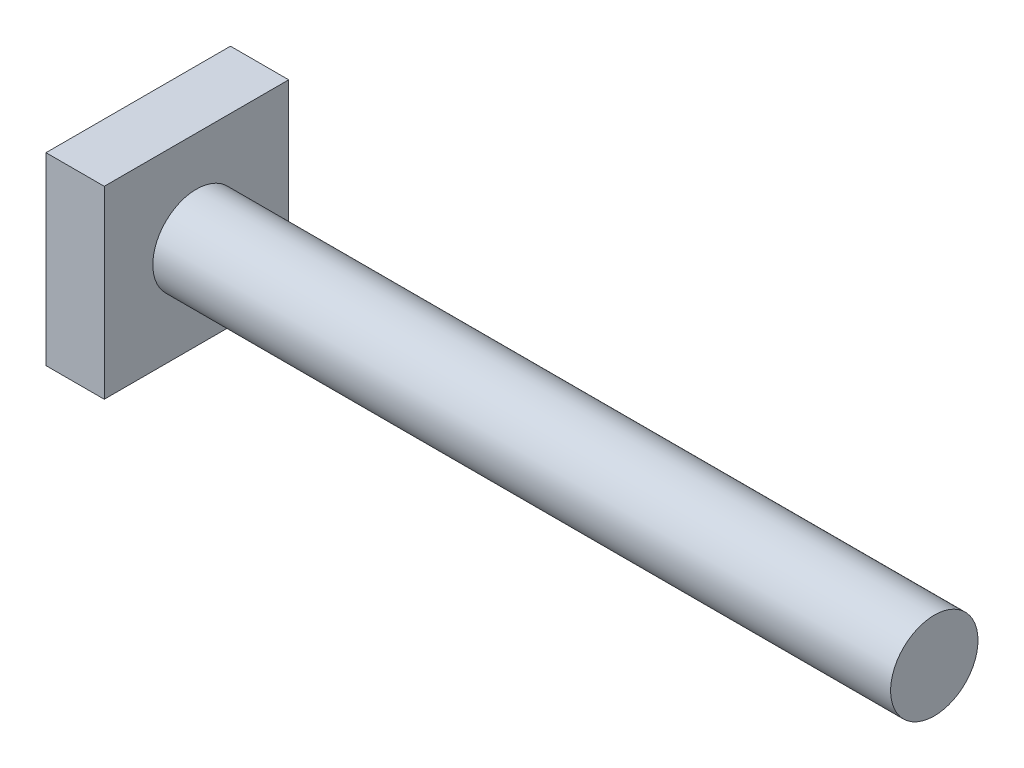
ISO-10303-21;
HEADER;
FILE_DESCRIPTION(('STEP AP214'),'2;1');
FILE_NAME('part.step','',(''),(''),'','','');
FILE_SCHEMA(('AUTOMOTIVE_DESIGN { 1 0 10303 214 1 1 1 1 }'));
ENDSEC;
DATA;
#1=APPLICATION_CONTEXT('core data for automotive mechanical design processes');
#2=APPLICATION_PROTOCOL_DEFINITION('international standard','automotive_design',2000,#1);
#3=PRODUCT_CONTEXT('',#1,'mechanical');
#4=PRODUCT('Part','Part','',(#3));
#5=PRODUCT_RELATED_PRODUCT_CATEGORY('part','',(#4));
#6=PRODUCT_DEFINITION_FORMATION('','',#4);
#7=PRODUCT_DEFINITION_CONTEXT('part definition',#1,'design');
#8=PRODUCT_DEFINITION('design','',#6,#7);
#9=PRODUCT_DEFINITION_SHAPE('','',#8);
#10=(LENGTH_UNIT() NAMED_UNIT(*) SI_UNIT(.MILLI.,.METRE.));
#11=(NAMED_UNIT(*) PLANE_ANGLE_UNIT() SI_UNIT($,.RADIAN.));
#12=(NAMED_UNIT(*) SI_UNIT($,.STERADIAN.) SOLID_ANGLE_UNIT());
#13=UNCERTAINTY_MEASURE_WITH_UNIT(LENGTH_MEASURE(1.E-05),#10,'distance_accuracy_value','');
#14=(GEOMETRIC_REPRESENTATION_CONTEXT(3) GLOBAL_UNCERTAINTY_ASSIGNED_CONTEXT((#13)) GLOBAL_UNIT_ASSIGNED_CONTEXT((#10,
#11,#12)) REPRESENTATION_CONTEXT('',''));
#15=CARTESIAN_POINT('',(0.,0.,0.));
#16=DIRECTION('',(0.,0.,1.));
#17=DIRECTION('',(1.,0.,0.));
#18=AXIS2_PLACEMENT_3D('',#15,#16,#17);
#19=CARTESIAN_POINT('',(1930.4,0.,0.));
#20=DIRECTION('',(-1.,0.,0.));
#21=DIRECTION('',(0.,0.,1.));
#22=AXIS2_PLACEMENT_3D('',#19,#20,#21);
#23=CYLINDRICAL_SURFACE('',#22,114.3);
#24=CARTESIAN_POINT('',(1930.4,0.,0.));
#25=DIRECTION('',(1.,0.,0.));
#26=DIRECTION('',(0.,0.,-1.));
#27=AXIS2_PLACEMENT_3D('',#24,#25,#26);
#28=CIRCLE('',#27,114.3);
#29=CARTESIAN_POINT('',(1930.4,0.,-114.3));
#30=VERTEX_POINT('',#29);
#31=EDGE_CURVE('E11',#30,#30,#28,.T.);
#32=ORIENTED_EDGE('',*,*,#31,.F.);
#33=EDGE_LOOP('',(#32));
#34=FACE_BOUND('',#33,.T.);
#35=CARTESIAN_POINT('',(0.,0.,0.));
#36=DIRECTION('',(1.,0.,0.));
#37=DIRECTION('',(0.,0.,-1.));
#38=AXIS2_PLACEMENT_3D('',#35,#36,#37);
#39=CIRCLE('',#38,114.3);
#40=CARTESIAN_POINT('',(0.,0.,-114.3));
#41=VERTEX_POINT('',#40);
#42=EDGE_CURVE('E41',#41,#41,#39,.T.);
#43=ORIENTED_EDGE('',*,*,#42,.T.);
#44=EDGE_LOOP('',(#43));
#45=FACE_BOUND('',#44,.T.);
#46=ADVANCED_FACE('F33',(#34,#45),#23,.T.);
#47=CARTESIAN_POINT('',(1930.4,0.,0.));
#48=DIRECTION('',(1.,0.,0.));
#49=DIRECTION('',(0.,0.,-1.));
#50=AXIS2_PLACEMENT_3D('',#47,#48,#49);
#51=PLANE('',#50);
#52=ORIENTED_EDGE('',*,*,#31,.T.);
#53=EDGE_LOOP('',(#52));
#54=FACE_BOUND('',#53,.T.);
#55=ADVANCED_FACE('F129',(#54),#51,.T.);
#56=CARTESIAN_POINT('',(-152.4,-241.3,241.3));
#57=DIRECTION('',(0.,0.,-1.));
#58=DIRECTION('',(-1.,0.,0.));
#59=AXIS2_PLACEMENT_3D('',#56,#57,#58);
#60=PLANE('',#59);
#61=DIRECTION('',(0.,1.,0.));
#62=VECTOR('',#61,1.);
#63=CARTESIAN_POINT('',(0.,-241.3,241.3));
#64=LINE('',#63,#62);
#65=CARTESIAN_POINT('',(0.,-241.3,241.3));
#66=VERTEX_POINT('',#65);
#67=CARTESIAN_POINT('',(0.,241.3,241.3));
#68=VERTEX_POINT('',#67);
#69=EDGE_CURVE('E100',#66,#68,#64,.T.);
#70=ORIENTED_EDGE('',*,*,#69,.T.);
#71=DIRECTION('',(1.,0.,0.));
#72=VECTOR('',#71,1.);
#73=CARTESIAN_POINT('',(-152.4,241.3,241.3));
#74=LINE('',#73,#72);
#75=CARTESIAN_POINT('',(-152.4,241.3,241.3));
#76=VERTEX_POINT('',#75);
#77=EDGE_CURVE('E91',#76,#68,#74,.T.);
#78=ORIENTED_EDGE('',*,*,#77,.F.);
#79=DIRECTION('',(0.,1.,0.));
#80=VECTOR('',#79,1.);
#81=CARTESIAN_POINT('',(-152.4,-241.3,241.3));
#82=LINE('',#81,#80);
#83=CARTESIAN_POINT('',(-152.4,-241.3,241.3));
#84=VERTEX_POINT('',#83);
#85=EDGE_CURVE('E85',#84,#76,#82,.T.);
#86=ORIENTED_EDGE('',*,*,#85,.F.);
#87=DIRECTION('',(1.,0.,0.));
#88=VECTOR('',#87,1.);
#89=CARTESIAN_POINT('',(-152.4,-241.3,241.3));
#90=LINE('',#89,#88);
#91=EDGE_CURVE('E96',#84,#66,#90,.T.);
#92=ORIENTED_EDGE('',*,*,#91,.T.);
#93=EDGE_LOOP('',(#70,#78,#86,#92));
#94=FACE_BOUND('',#93,.T.);
#95=ADVANCED_FACE('F118',(#94),#60,.F.);
#96=CARTESIAN_POINT('',(-152.4,241.3,-241.3));
#97=DIRECTION('',(0.,-1.,0.));
#98=DIRECTION('',(0.,0.,-1.));
#99=AXIS2_PLACEMENT_3D('',#96,#97,#98);
#100=PLANE('',#99);
#101=DIRECTION('',(0.,0.,-1.));
#102=VECTOR('',#101,1.);
#103=CARTESIAN_POINT('',(0.,241.3,-241.3));
#104=LINE('',#103,#102);
#105=CARTESIAN_POINT('',(0.,241.3,-241.3));
#106=VERTEX_POINT('',#105);
#107=EDGE_CURVE('E90',#68,#106,#104,.T.);
#108=ORIENTED_EDGE('',*,*,#107,.T.);
#109=DIRECTION('',(1.,0.,0.));
#110=VECTOR('',#109,1.);
#111=CARTESIAN_POINT('',(-152.4,241.3,-241.3));
#112=LINE('',#111,#110);
#113=CARTESIAN_POINT('',(-152.4,241.3,-241.3));
#114=VERTEX_POINT('',#113);
#115=EDGE_CURVE('E88',#114,#106,#112,.T.);
#116=ORIENTED_EDGE('',*,*,#115,.F.);
#117=DIRECTION('',(0.,0.,-1.));
#118=VECTOR('',#117,1.);
#119=CARTESIAN_POINT('',(-152.4,241.3,-241.3));
#120=LINE('',#119,#118);
#121=EDGE_CURVE('E80',#76,#114,#120,.T.);
#122=ORIENTED_EDGE('',*,*,#121,.F.);
#123=ORIENTED_EDGE('',*,*,#77,.T.);
#124=EDGE_LOOP('',(#108,#116,#122,#123));
#125=FACE_BOUND('',#124,.T.);
#126=ADVANCED_FACE('F89',(#125),#100,.F.);
#127=CARTESIAN_POINT('',(-152.4,-241.3,-241.3));
#128=DIRECTION('',(0.,0.,1.));
#129=DIRECTION('',(1.,0.,0.));
#130=AXIS2_PLACEMENT_3D('',#127,#128,#129);
#131=PLANE('',#130);
#132=DIRECTION('',(0.,-1.,0.));
#133=VECTOR('',#132,1.);
#134=CARTESIAN_POINT('',(0.,-241.3,-241.3));
#135=LINE('',#134,#133);
#136=CARTESIAN_POINT('',(0.,-241.3,-241.3));
#137=VERTEX_POINT('',#136);
#138=EDGE_CURVE('E66',#106,#137,#135,.T.);
#139=ORIENTED_EDGE('',*,*,#138,.T.);
#140=DIRECTION('',(1.,0.,0.));
#141=VECTOR('',#140,1.);
#142=CARTESIAN_POINT('',(-152.4,-241.3,-241.3));
#143=LINE('',#142,#141);
#144=CARTESIAN_POINT('',(-152.4,-241.3,-241.3));
#145=VERTEX_POINT('',#144);
#146=EDGE_CURVE('E92',#145,#137,#143,.T.);
#147=ORIENTED_EDGE('',*,*,#146,.F.);
#148=DIRECTION('',(0.,-1.,0.));
#149=VECTOR('',#148,1.);
#150=CARTESIAN_POINT('',(-152.4,-241.3,-241.3));
#151=LINE('',#150,#149);
#152=EDGE_CURVE('E83',#114,#145,#151,.T.);
#153=ORIENTED_EDGE('',*,*,#152,.F.);
#154=ORIENTED_EDGE('',*,*,#115,.T.);
#155=EDGE_LOOP('',(#139,#147,#153,#154));
#156=FACE_BOUND('',#155,.T.);
#157=ADVANCED_FACE('F94',(#156),#131,.F.);
#158=CARTESIAN_POINT('',(-152.4,-241.3,-241.3));
#159=DIRECTION('',(0.,1.,0.));
#160=DIRECTION('',(0.,0.,1.));
#161=AXIS2_PLACEMENT_3D('',#158,#159,#160);
#162=PLANE('',#161);
#163=DIRECTION('',(0.,0.,1.));
#164=VECTOR('',#163,1.);
#165=CARTESIAN_POINT('',(0.,-241.3,-241.3));
#166=LINE('',#165,#164);
#167=EDGE_CURVE('E72',#137,#66,#166,.T.);
#168=ORIENTED_EDGE('',*,*,#167,.T.);
#169=ORIENTED_EDGE('',*,*,#91,.F.);
#170=DIRECTION('',(0.,0.,1.));
#171=VECTOR('',#170,1.);
#172=CARTESIAN_POINT('',(-152.4,-241.3,-241.3));
#173=LINE('',#172,#171);
#174=EDGE_CURVE('E49',#145,#84,#173,.T.);
#175=ORIENTED_EDGE('',*,*,#174,.F.);
#176=ORIENTED_EDGE('',*,*,#146,.T.);
#177=EDGE_LOOP('',(#168,#169,#175,#176));
#178=FACE_BOUND('',#177,.T.);
#179=ADVANCED_FACE('F119',(#178),#162,.F.);
#180=CARTESIAN_POINT('',(-152.4,0.,0.));
#181=DIRECTION('',(1.,0.,0.));
#182=DIRECTION('',(0.,0.,-1.));
#183=AXIS2_PLACEMENT_3D('',#180,#181,#182);
#184=PLANE('',#183);
#185=ORIENTED_EDGE('',*,*,#85,.T.);
#186=ORIENTED_EDGE('',*,*,#121,.T.);
#187=ORIENTED_EDGE('',*,*,#152,.T.);
#188=ORIENTED_EDGE('',*,*,#174,.T.);
#189=EDGE_LOOP('',(#185,#186,#187,#188));
#190=FACE_BOUND('',#189,.T.);
#191=ADVANCED_FACE('F81',(#190),#184,.F.);
#192=CARTESIAN_POINT('',(0.,0.,0.));
#193=DIRECTION('',(1.,0.,0.));
#194=DIRECTION('',(0.,0.,-1.));
#195=AXIS2_PLACEMENT_3D('',#192,#193,#194);
#196=PLANE('',#195);
#197=ORIENTED_EDGE('',*,*,#42,.F.);
#198=EDGE_LOOP('',(#197));
#199=FACE_BOUND('',#198,.T.);
#200=ORIENTED_EDGE('',*,*,#69,.F.);
#201=ORIENTED_EDGE('',*,*,#167,.F.);
#202=ORIENTED_EDGE('',*,*,#138,.F.);
#203=ORIENTED_EDGE('',*,*,#107,.F.);
#204=EDGE_LOOP('',(#200,#201,#202,#203));
#205=FACE_BOUND('',#204,.T.);
#206=ADVANCED_FACE('F112',(#199,#205),#196,.T.);
#207=CLOSED_SHELL('',(#46,#55,#95,#126,#157,#179,#191,#206));
#208=MANIFOLD_SOLID_BREP('B2',#207);
#209=ADVANCED_BREP_SHAPE_REPRESENTATION('',(#18,#208),#14);
#210=SHAPE_DEFINITION_REPRESENTATION(#9,#209);
ENDSEC;
END-ISO-10303-21;
